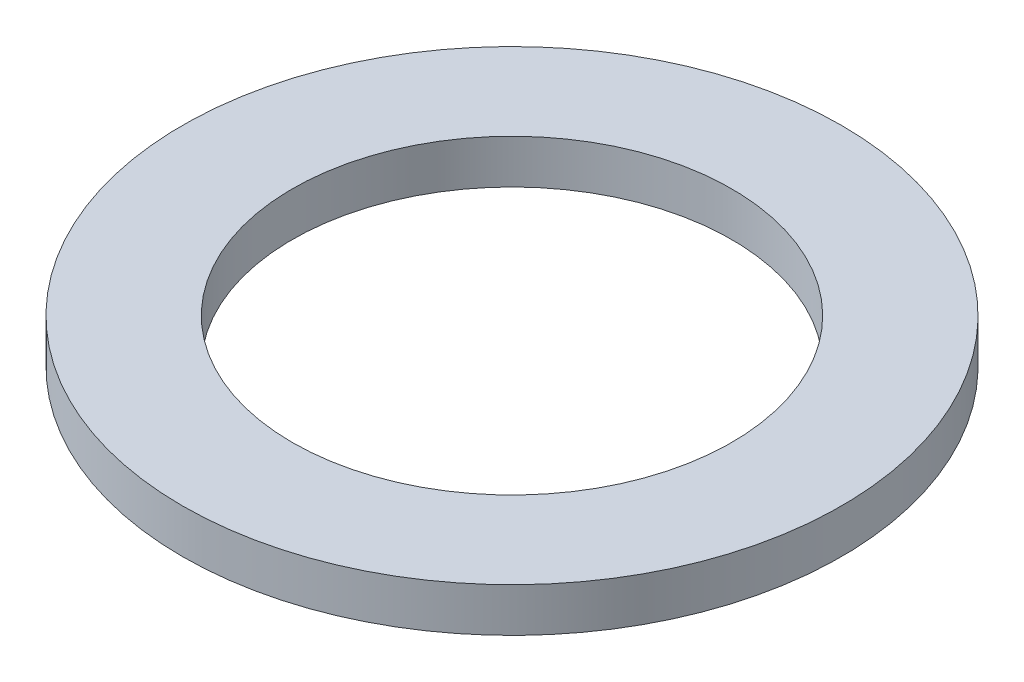
ISO-10303-21;
HEADER;
FILE_DESCRIPTION(('STEP AP214'),'2;1');
FILE_NAME('part.step','',(''),(''),'','','');
FILE_SCHEMA(('AUTOMOTIVE_DESIGN { 1 0 10303 214 1 1 1 1 }'));
ENDSEC;
DATA;
#1=APPLICATION_CONTEXT('core data for automotive mechanical design processes');
#2=APPLICATION_PROTOCOL_DEFINITION('international standard','automotive_design',2000,#1);
#3=PRODUCT_CONTEXT('',#1,'mechanical');
#4=PRODUCT('Part','Part','',(#3));
#5=PRODUCT_RELATED_PRODUCT_CATEGORY('part','',(#4));
#6=PRODUCT_DEFINITION_FORMATION('','',#4);
#7=PRODUCT_DEFINITION_CONTEXT('part definition',#1,'design');
#8=PRODUCT_DEFINITION('design','',#6,#7);
#9=PRODUCT_DEFINITION_SHAPE('','',#8);
#10=(LENGTH_UNIT() NAMED_UNIT(*) SI_UNIT(.MILLI.,.METRE.));
#11=(NAMED_UNIT(*) PLANE_ANGLE_UNIT() SI_UNIT($,.RADIAN.));
#12=(NAMED_UNIT(*) SI_UNIT($,.STERADIAN.) SOLID_ANGLE_UNIT());
#13=UNCERTAINTY_MEASURE_WITH_UNIT(LENGTH_MEASURE(1.E-05),#10,'distance_accuracy_value','');
#14=(GEOMETRIC_REPRESENTATION_CONTEXT(3) GLOBAL_UNCERTAINTY_ASSIGNED_CONTEXT((#13)) GLOBAL_UNIT_ASSIGNED_CONTEXT((#10,
#11,#12)) REPRESENTATION_CONTEXT('',''));
#15=CARTESIAN_POINT('',(0.,0.,0.));
#16=DIRECTION('',(0.,0.,1.));
#17=DIRECTION('',(1.,0.,0.));
#18=AXIS2_PLACEMENT_3D('',#15,#16,#17);
#19=CARTESIAN_POINT('',(0.,6.,0.));
#20=DIRECTION('',(0.,-1.,0.));
#21=DIRECTION('',(0.,0.,-1.));
#22=AXIS2_PLACEMENT_3D('',#19,#20,#21);
#23=CYLINDRICAL_SURFACE('',#22,45.);
#24=CARTESIAN_POINT('',(0.,6.,0.));
#25=DIRECTION('',(0.,1.,0.));
#26=DIRECTION('',(0.,0.,1.));
#27=AXIS2_PLACEMENT_3D('',#24,#25,#26);
#28=CIRCLE('',#27,45.);
#29=CARTESIAN_POINT('',(0.,6.,45.));
#30=VERTEX_POINT('',#29);
#31=EDGE_CURVE('E10',#30,#30,#28,.T.);
#32=ORIENTED_EDGE('',*,*,#31,.F.);
#33=EDGE_LOOP('',(#32));
#34=FACE_BOUND('',#33,.T.);
#35=CARTESIAN_POINT('',(0.,0.,0.));
#36=DIRECTION('',(0.,1.,0.));
#37=DIRECTION('',(0.,0.,1.));
#38=AXIS2_PLACEMENT_3D('',#35,#36,#37);
#39=CIRCLE('',#38,45.);
#40=CARTESIAN_POINT('',(0.,0.,45.));
#41=VERTEX_POINT('',#40);
#42=EDGE_CURVE('E37',#41,#41,#39,.T.);
#43=ORIENTED_EDGE('',*,*,#42,.T.);
#44=EDGE_LOOP('',(#43));
#45=FACE_BOUND('',#44,.T.);
#46=ADVANCED_FACE('F40',(#34,#45),#23,.T.);
#47=CARTESIAN_POINT('',(0.,6.,0.));
#48=DIRECTION('',(0.,1.,0.));
#49=DIRECTION('',(0.,0.,1.));
#50=AXIS2_PLACEMENT_3D('',#47,#48,#49);
#51=PLANE('',#50);
#52=CARTESIAN_POINT('',(0.,6.,0.));
#53=DIRECTION('',(0.,1.,0.));
#54=DIRECTION('',(0.,0.,1.));
#55=AXIS2_PLACEMENT_3D('',#52,#53,#54);
#56=CIRCLE('',#55,30.);
#57=CARTESIAN_POINT('',(0.,6.,30.));
#58=VERTEX_POINT('',#57);
#59=EDGE_CURVE('E50',#58,#58,#56,.T.);
#60=ORIENTED_EDGE('',*,*,#59,.F.);
#61=EDGE_LOOP('',(#60));
#62=FACE_BOUND('',#61,.T.);
#63=ORIENTED_EDGE('',*,*,#31,.T.);
#64=EDGE_LOOP('',(#63));
#65=FACE_BOUND('',#64,.T.);
#66=ADVANCED_FACE('F59',(#62,#65),#51,.T.);
#67=CARTESIAN_POINT('',(0.,0.,0.));
#68=DIRECTION('',(0.,1.,0.));
#69=DIRECTION('',(0.,0.,1.));
#70=AXIS2_PLACEMENT_3D('',#67,#68,#69);
#71=PLANE('',#70);
#72=CARTESIAN_POINT('',(0.,0.,0.));
#73=DIRECTION('',(0.,1.,0.));
#74=DIRECTION('',(0.,0.,1.));
#75=AXIS2_PLACEMENT_3D('',#72,#73,#74);
#76=CIRCLE('',#75,30.);
#77=CARTESIAN_POINT('',(0.,0.,30.));
#78=VERTEX_POINT('',#77);
#79=EDGE_CURVE('E47',#78,#78,#76,.T.);
#80=ORIENTED_EDGE('',*,*,#79,.T.);
#81=EDGE_LOOP('',(#80));
#82=FACE_BOUND('',#81,.T.);
#83=ORIENTED_EDGE('',*,*,#42,.F.);
#84=EDGE_LOOP('',(#83));
#85=FACE_BOUND('',#84,.T.);
#86=ADVANCED_FACE('F58',(#82,#85),#71,.F.);
#87=CARTESIAN_POINT('',(0.,6.,0.));
#88=DIRECTION('',(0.,-1.,0.));
#89=DIRECTION('',(0.,0.,-1.));
#90=AXIS2_PLACEMENT_3D('',#87,#88,#89);
#91=CYLINDRICAL_SURFACE('',#90,30.);
#92=ORIENTED_EDGE('',*,*,#59,.T.);
#93=EDGE_LOOP('',(#92));
#94=FACE_BOUND('',#93,.T.);
#95=ORIENTED_EDGE('',*,*,#79,.F.);
#96=EDGE_LOOP('',(#95));
#97=FACE_BOUND('',#96,.T.);
#98=ADVANCED_FACE('F54',(#94,#97),#91,.F.);
#99=CLOSED_SHELL('',(#46,#66,#86,#98));
#100=MANIFOLD_SOLID_BREP('B2',#99);
#101=ADVANCED_BREP_SHAPE_REPRESENTATION('',(#18,#100),#14);
#102=SHAPE_DEFINITION_REPRESENTATION(#9,#101);
ENDSEC;
END-ISO-10303-21;
